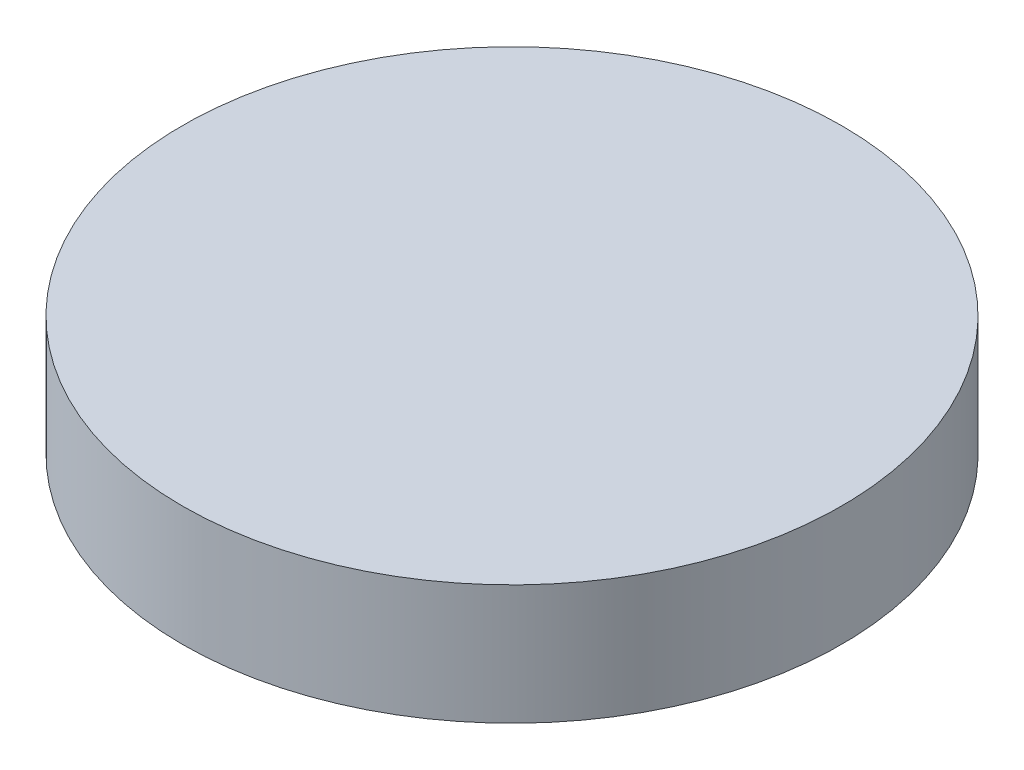
ISO-10303-21;
HEADER;
FILE_DESCRIPTION(('STEP AP214'),'2;1');
FILE_NAME('part.step','',(''),(''),'','','');
FILE_SCHEMA(('AUTOMOTIVE_DESIGN { 1 0 10303 214 1 1 1 1 }'));
ENDSEC;
DATA;
#1=APPLICATION_CONTEXT('core data for automotive mechanical design processes');
#2=APPLICATION_PROTOCOL_DEFINITION('international standard','automotive_design',2000,#1);
#3=PRODUCT_CONTEXT('',#1,'mechanical');
#4=PRODUCT('Part','Part','',(#3));
#5=PRODUCT_RELATED_PRODUCT_CATEGORY('part','',(#4));
#6=PRODUCT_DEFINITION_FORMATION('','',#4);
#7=PRODUCT_DEFINITION_CONTEXT('part definition',#1,'design');
#8=PRODUCT_DEFINITION('design','',#6,#7);
#9=PRODUCT_DEFINITION_SHAPE('','',#8);
#10=(LENGTH_UNIT() NAMED_UNIT(*) SI_UNIT(.MILLI.,.METRE.));
#11=(NAMED_UNIT(*) PLANE_ANGLE_UNIT() SI_UNIT($,.RADIAN.));
#12=(NAMED_UNIT(*) SI_UNIT($,.STERADIAN.) SOLID_ANGLE_UNIT());
#13=UNCERTAINTY_MEASURE_WITH_UNIT(LENGTH_MEASURE(1.E-05),#10,'distance_accuracy_value','');
#14=(GEOMETRIC_REPRESENTATION_CONTEXT(3) GLOBAL_UNCERTAINTY_ASSIGNED_CONTEXT((#13)) GLOBAL_UNIT_ASSIGNED_CONTEXT((#10,
#11,#12)) REPRESENTATION_CONTEXT('',''));
#15=CARTESIAN_POINT('',(0.,0.,0.));
#16=DIRECTION('',(0.,0.,1.));
#17=DIRECTION('',(1.,0.,0.));
#18=AXIS2_PLACEMENT_3D('',#15,#16,#17);
#19=CARTESIAN_POINT('',(0.,3.,0.));
#20=DIRECTION('',(0.,-1.,0.));
#21=DIRECTION('',(0.,0.,-1.));
#22=AXIS2_PLACEMENT_3D('',#19,#20,#21);
#23=CYLINDRICAL_SURFACE('',#22,8.25);
#24=CARTESIAN_POINT('',(0.,3.,0.));
#25=DIRECTION('',(0.,1.,0.));
#26=DIRECTION('',(0.,0.,1.));
#27=AXIS2_PLACEMENT_3D('',#24,#25,#26);
#28=CIRCLE('',#27,8.25);
#29=CARTESIAN_POINT('',(0.,3.,8.25));
#30=VERTEX_POINT('',#29);
#31=EDGE_CURVE('E10',#30,#30,#28,.T.);
#32=ORIENTED_EDGE('',*,*,#31,.F.);
#33=EDGE_LOOP('',(#32));
#34=FACE_BOUND('',#33,.T.);
#35=CARTESIAN_POINT('',(0.,0.,0.));
#36=DIRECTION('',(0.,1.,0.));
#37=DIRECTION('',(0.,0.,1.));
#38=AXIS2_PLACEMENT_3D('',#35,#36,#37);
#39=CIRCLE('',#38,8.25);
#40=CARTESIAN_POINT('',(0.,0.,8.25));
#41=VERTEX_POINT('',#40);
#42=EDGE_CURVE('E36',#41,#41,#39,.T.);
#43=ORIENTED_EDGE('',*,*,#42,.T.);
#44=EDGE_LOOP('',(#43));
#45=FACE_BOUND('',#44,.T.);
#46=ADVANCED_FACE('F33',(#34,#45),#23,.T.);
#47=CARTESIAN_POINT('',(0.,3.,0.));
#48=DIRECTION('',(0.,1.,0.));
#49=DIRECTION('',(0.,0.,1.));
#50=AXIS2_PLACEMENT_3D('',#47,#48,#49);
#51=PLANE('',#50);
#52=ORIENTED_EDGE('',*,*,#31,.T.);
#53=EDGE_LOOP('',(#52));
#54=FACE_BOUND('',#53,.T.);
#55=ADVANCED_FACE('F48',(#54),#51,.T.);
#56=CARTESIAN_POINT('',(0.,0.,0.));
#57=DIRECTION('',(0.,1.,0.));
#58=DIRECTION('',(0.,0.,1.));
#59=AXIS2_PLACEMENT_3D('',#56,#57,#58);
#60=PLANE('',#59);
#61=ORIENTED_EDGE('',*,*,#42,.F.);
#62=EDGE_LOOP('',(#61));
#63=FACE_BOUND('',#62,.T.);
#64=ADVANCED_FACE('F46',(#63),#60,.F.);
#65=CLOSED_SHELL('',(#46,#55,#64));
#66=MANIFOLD_SOLID_BREP('B2',#65);
#67=ADVANCED_BREP_SHAPE_REPRESENTATION('',(#18,#66),#14);
#68=SHAPE_DEFINITION_REPRESENTATION(#9,#67);
ENDSEC;
END-ISO-10303-21;
